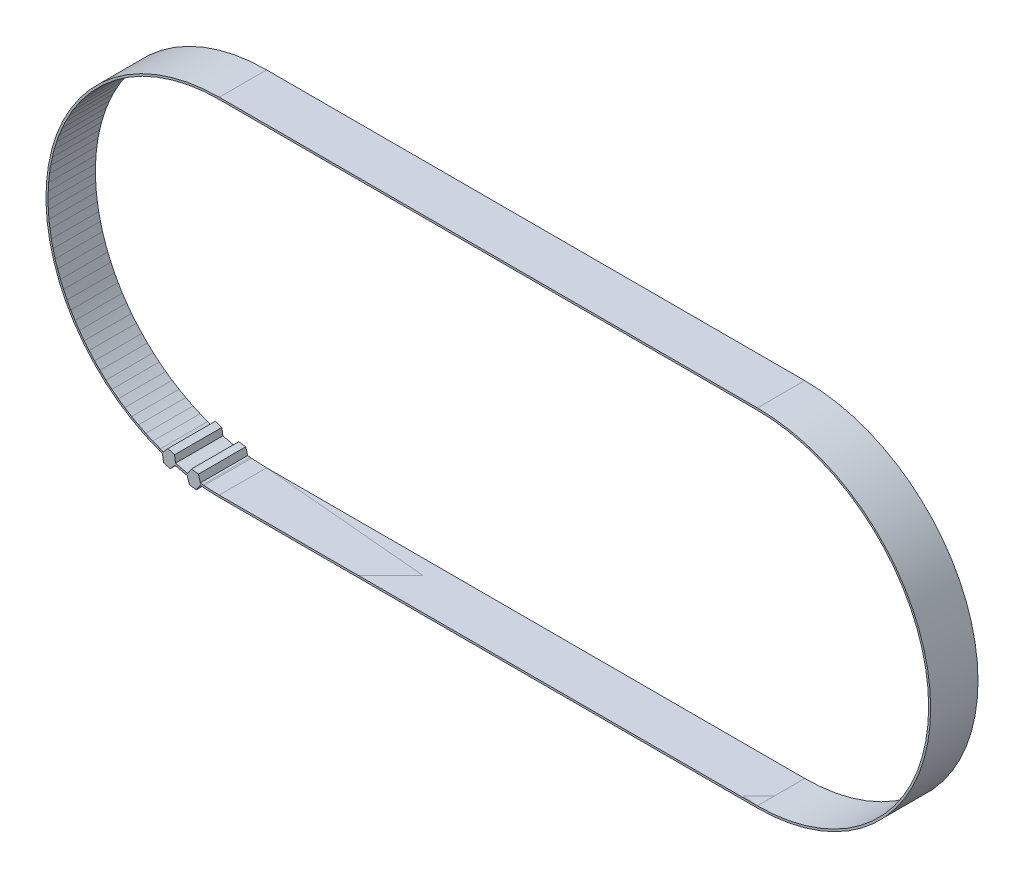
ISO-10303-21;
HEADER;
FILE_DESCRIPTION(('STEP AP214'),'2;1');
FILE_NAME('part.step','',(''),(''),'','','');
FILE_SCHEMA(('AUTOMOTIVE_DESIGN { 1 0 10303 214 1 1 1 1 }'));
ENDSEC;
DATA;
#1=APPLICATION_CONTEXT('core data for automotive mechanical design processes');
#2=APPLICATION_PROTOCOL_DEFINITION('international standard','automotive_design',2000,#1);
#3=PRODUCT_CONTEXT('',#1,'mechanical');
#4=PRODUCT('Part','Part','',(#3));
#5=PRODUCT_RELATED_PRODUCT_CATEGORY('part','',(#4));
#6=PRODUCT_DEFINITION_FORMATION('','',#4);
#7=PRODUCT_DEFINITION_CONTEXT('part definition',#1,'design');
#8=PRODUCT_DEFINITION('design','',#6,#7);
#9=PRODUCT_DEFINITION_SHAPE('','',#8);
#10=(LENGTH_UNIT() NAMED_UNIT(*) SI_UNIT(.MILLI.,.METRE.));
#11=(NAMED_UNIT(*) PLANE_ANGLE_UNIT() SI_UNIT($,.RADIAN.));
#12=(NAMED_UNIT(*) SI_UNIT($,.STERADIAN.) SOLID_ANGLE_UNIT());
#13=UNCERTAINTY_MEASURE_WITH_UNIT(LENGTH_MEASURE(1.E-05),#10,'distance_accuracy_value','');
#14=(GEOMETRIC_REPRESENTATION_CONTEXT(3) GLOBAL_UNCERTAINTY_ASSIGNED_CONTEXT((#13)) GLOBAL_UNIT_ASSIGNED_CONTEXT((#10,
#11,#12)) REPRESENTATION_CONTEXT('',''));
#15=CARTESIAN_POINT('',(0.,0.,0.));
#16=DIRECTION('',(0.,0.,1.));
#17=DIRECTION('',(1.,0.,0.));
#18=AXIS2_PLACEMENT_3D('',#15,#16,#17);
#19=CARTESIAN_POINT('',(-58.59456374968,-35.77128986789,4.75));
#20=DIRECTION('',(-0.147301698054607,-0.98909160837115,0.));
#21=DIRECTION('',(0.98909160837115,-0.147301698054607,0.));
#22=AXIS2_PLACEMENT_3D('',#19,#20,#21);
#23=PLANE('',#22);
#24=DIRECTION('',(0.,0.,1.));
#25=VECTOR('',#24,1.);
#26=CARTESIAN_POINT('',(-58.5945637496801,-35.77128986789,4.75));
#27=LINE('',#26,#25);
#28=CARTESIAN_POINT('',(-58.59456374968,-35.77128986789,4.75));
#29=VERTEX_POINT('',#28);
#30=CARTESIAN_POINT('',(-58.59456374968,-35.77128986789,-4.75));
#31=VERTEX_POINT('',#30);
#32=EDGE_CURVE('P0_E142',#29,#31,#27,.F.);
#33=ORIENTED_EDGE('',*,*,#32,.F.);
#34=DIRECTION('',(0.98909160837115,-0.147301698054607,0.));
#35=VECTOR('',#34,1.);
#36=CARTESIAN_POINT('',(-58.59456374968,-35.77128986789,4.75));
#37=LINE('',#36,#35);
#38=CARTESIAN_POINT('',(-59.9792920014002,-35.5650674906111,4.75));
#39=VERTEX_POINT('',#38);
#40=EDGE_CURVE('P0_E138',#29,#39,#37,.F.);
#41=ORIENTED_EDGE('',*,*,#40,.T.);
#42=DIRECTION('',(0.,0.,1.));
#43=VECTOR('',#42,1.);
#44=CARTESIAN_POINT('',(-59.9792920014,-35.56506749061,4.75));
#45=LINE('',#44,#43);
#46=CARTESIAN_POINT('',(-59.9792920014002,-35.5650674906111,-4.75));
#47=VERTEX_POINT('',#46);
#48=EDGE_CURVE('P0_E223',#47,#39,#45,.T.);
#49=ORIENTED_EDGE('',*,*,#48,.F.);
#50=DIRECTION('',(0.98909160837115,-0.147301698054607,0.));
#51=VECTOR('',#50,1.);
#52=CARTESIAN_POINT('',(-58.59456374968,-35.77128986789,-4.75));
#53=LINE('',#52,#51);
#54=EDGE_CURVE('P0_E258',#47,#31,#53,.T.);
#55=ORIENTED_EDGE('',*,*,#54,.T.);
#56=EDGE_LOOP('',(#33,#41,#49,#55));
#57=FACE_BOUND('',#56,.T.);
#58=ADVANCED_FACE('P0_F17',(#57),#23,.T.);
#59=CARTESIAN_POINT('',(-64.27842042492,-31.42285414019,4.75));
#60=DIRECTION('',(0.291389746889314,0.956604419500444,0.));
#61=DIRECTION('',(-0.956604419500444,0.291389746889314,0.));
#62=AXIS2_PLACEMENT_3D('',#59,#60,#61);
#63=PLANE('',#62);
#64=DIRECTION('',(0.,0.,1.));
#65=VECTOR('',#64,1.);
#66=CARTESIAN_POINT('',(-64.2784204249181,-31.4228541401918,4.75));
#67=LINE('',#66,#65);
#68=CARTESIAN_POINT('',(-64.2784204249187,-31.4228541401912,4.75));
#69=VERTEX_POINT('',#68);
#70=CARTESIAN_POINT('',(-64.2784204249187,-31.4228541401912,-4.75));
#71=VERTEX_POINT('',#70);
#72=EDGE_CURVE('P0_E203',#69,#71,#67,.F.);
#73=ORIENTED_EDGE('',*,*,#72,.F.);
#74=DIRECTION('',(-0.956604419500444,0.291389746889314,0.));
#75=VECTOR('',#74,1.);
#76=CARTESIAN_POINT('',(-64.27842042492,-31.42285414019,4.75));
#77=LINE('',#76,#75);
#78=CARTESIAN_POINT('',(-62.9391742376195,-31.8307997858384,4.75));
#79=VERTEX_POINT('',#78);
#80=EDGE_CURVE('P0_E239',#69,#79,#77,.F.);
#81=ORIENTED_EDGE('',*,*,#80,.T.);
#82=DIRECTION('',(0.,0.,1.));
#83=VECTOR('',#82,1.);
#84=CARTESIAN_POINT('',(-62.93917423762,-31.83079978584,4.75));
#85=LINE('',#84,#83);
#86=CARTESIAN_POINT('',(-62.9391742376195,-31.8307997858384,-4.75));
#87=VERTEX_POINT('',#86);
#88=EDGE_CURVE('P0_E197',#87,#79,#85,.T.);
#89=ORIENTED_EDGE('',*,*,#88,.F.);
#90=DIRECTION('',(-0.956604419500444,0.291389746889314,0.));
#91=VECTOR('',#90,1.);
#92=CARTESIAN_POINT('',(-64.27842042492,-31.42285414019,-4.75));
#93=LINE('',#92,#91);
#94=EDGE_CURVE('P0_E246',#87,#71,#93,.T.);
#95=ORIENTED_EDGE('',*,*,#94,.T.);
#96=EDGE_LOOP('',(#73,#81,#89,#95));
#97=FACE_BOUND('',#96,.T.);
#98=ADVANCED_FACE('P0_F438',(#97),#63,.T.);
#99=CARTESIAN_POINT('',(-59.53738690724,-32.5977926655,4.75));
#100=DIRECTION('',(0.147301698054607,0.98909160837115,0.));
#101=DIRECTION('',(-0.98909160837115,0.147301698054607,0.));
#102=AXIS2_PLACEMENT_3D('',#99,#100,#101);
#103=PLANE('',#102);
#104=DIRECTION('',(0.,0.,1.));
#105=VECTOR('',#104,1.);
#106=CARTESIAN_POINT('',(-59.5373869072399,-32.5977926655,4.75));
#107=LINE('',#106,#105);
#108=CARTESIAN_POINT('',(-59.5373869072399,-32.5977926655,4.75));
#109=VERTEX_POINT('',#108);
#110=CARTESIAN_POINT('',(-59.53738690724,-32.5977926655,-4.75));
#111=VERTEX_POINT('',#110);
#112=EDGE_CURVE('P0_E191',#109,#111,#107,.F.);
#113=ORIENTED_EDGE('',*,*,#112,.F.);
#114=DIRECTION('',(-0.98909160837115,0.147301698054607,0.));
#115=VECTOR('',#114,1.);
#116=CARTESIAN_POINT('',(-59.53738690724,-32.5977926655,4.75));
#117=LINE('',#116,#115);
#118=CARTESIAN_POINT('',(-58.1526586555198,-32.8040150427789,4.75));
#119=VERTEX_POINT('',#118);
#120=EDGE_CURVE('P0_E233',#109,#119,#117,.F.);
#121=ORIENTED_EDGE('',*,*,#120,.T.);
#122=DIRECTION('',(0.,0.,1.));
#123=VECTOR('',#122,1.);
#124=CARTESIAN_POINT('',(-58.15265865552,-32.80401504278,4.75));
#125=LINE('',#124,#123);
#126=CARTESIAN_POINT('',(-58.1526586555198,-32.8040150427789,-4.75));
#127=VERTEX_POINT('',#126);
#128=EDGE_CURVE('P0_E209',#127,#119,#125,.T.);
#129=ORIENTED_EDGE('',*,*,#128,.F.);
#130=DIRECTION('',(-0.98909160837115,0.147301698054607,0.));
#131=VECTOR('',#130,1.);
#132=CARTESIAN_POINT('',(-59.53738690724,-32.5977926655,-4.75));
#133=LINE('',#132,#131);
#134=EDGE_CURVE('P0_E236',#127,#111,#133,.T.);
#135=ORIENTED_EDGE('',*,*,#134,.T.);
#136=EDGE_LOOP('',(#113,#121,#129,#135));
#137=FACE_BOUND('',#136,.T.);
#138=ADVANCED_FACE('P0_F353',(#137),#103,.T.);
#139=CARTESIAN_POINT('',(-63.81334347829,-34.70061304434,4.75));
#140=DIRECTION('',(-0.291389746889314,-0.956604419500444,0.));
#141=DIRECTION('',(0.956604419500444,-0.291389746889314,0.));
#142=AXIS2_PLACEMENT_3D('',#139,#140,#141);
#143=PLANE('',#142);
#144=DIRECTION('',(0.,0.,1.));
#145=VECTOR('',#144,1.);
#146=CARTESIAN_POINT('',(-63.813343478292,-34.7006130443382,4.75));
#147=LINE('',#146,#145);
#148=CARTESIAN_POINT('',(-63.8133434782913,-34.7006130443388,4.75));
#149=VERTEX_POINT('',#148);
#150=CARTESIAN_POINT('',(-63.8133434782913,-34.7006130443388,-4.75));
#151=VERTEX_POINT('',#150);
#152=EDGE_CURVE('P0_E217',#149,#151,#147,.F.);
#153=ORIENTED_EDGE('',*,*,#152,.F.);
#154=DIRECTION('',(0.956604419500444,-0.291389746889314,0.));
#155=VECTOR('',#154,1.);
#156=CARTESIAN_POINT('',(-63.81334347829,-34.70061304434,4.75));
#157=LINE('',#156,#155);
#158=CARTESIAN_POINT('',(-65.1525896655895,-34.2926673986985,4.75));
#159=VERTEX_POINT('',#158);
#160=EDGE_CURVE('P0_E143',#149,#159,#157,.F.);
#161=ORIENTED_EDGE('',*,*,#160,.T.);
#162=DIRECTION('',(0.,0.,1.));
#163=VECTOR('',#162,1.);
#164=CARTESIAN_POINT('',(-65.15258966559,-34.2926673987,4.75));
#165=LINE('',#164,#163);
#166=CARTESIAN_POINT('',(-65.1525896655895,-34.2926673986985,-4.75));
#167=VERTEX_POINT('',#166);
#168=EDGE_CURVE('P0_E187',#167,#159,#165,.T.);
#169=ORIENTED_EDGE('',*,*,#168,.F.);
#170=DIRECTION('',(0.956604419500444,-0.291389746889314,0.));
#171=VECTOR('',#170,1.);
#172=CARTESIAN_POINT('',(-63.81334347829,-34.70061304434,-4.75));
#173=LINE('',#172,#171);
#174=EDGE_CURVE('P0_E230',#167,#151,#173,.T.);
#175=ORIENTED_EDGE('',*,*,#174,.T.);
#176=EDGE_LOOP('',(#153,#161,#169,#175));
#177=FACE_BOUND('',#176,.T.);
#178=ADVANCED_FACE('P0_F396',(#177),#143,.T.);
#179=CARTESIAN_POINT('',(-57.6817797152,-34.39068432013,4.75));
#180=DIRECTION('',(0.834169039176063,-0.551508852222776,0.));
#181=DIRECTION('',(0.551508852222776,0.834169039176063,0.));
#182=AXIS2_PLACEMENT_3D('',#179,#180,#181);
#183=PLANE('',#182);
#184=DIRECTION('',(0.551508852222776,0.834169039176063,0.));
#185=VECTOR('',#184,1.);
#186=CARTESIAN_POINT('',(-57.6817797152,-34.39068432013,-4.75));
#187=LINE('',#186,#185);
#188=CARTESIAN_POINT('',(-57.7882770687173,-34.5517645033052,-4.75));
#189=VERTEX_POINT('',#188);
#190=EDGE_CURVE('P0_E149',#31,#189,#187,.T.);
#191=ORIENTED_EDGE('',*,*,#190,.T.);
#192=DIRECTION('',(0.,0.,-1.));
#193=VECTOR('',#192,1.);
#194=CARTESIAN_POINT('',(-57.7882766755705,-34.5517645466945,1.));
#195=LINE('',#194,#193);
#196=CARTESIAN_POINT('',(-57.7882770687173,-34.5517645033052,4.75));
#197=VERTEX_POINT('',#196);
#198=EDGE_CURVE('P0_E146',#197,#189,#195,.T.);
#199=ORIENTED_EDGE('',*,*,#198,.F.);
#200=DIRECTION('',(0.551508852222776,0.834169039176063,0.));
#201=VECTOR('',#200,1.);
#202=CARTESIAN_POINT('',(-57.6817797152,-34.39068432013,4.75));
#203=LINE('',#202,#201);
#204=EDGE_CURVE('P0_E130',#197,#29,#203,.F.);
#205=ORIENTED_EDGE('',*,*,#204,.T.);
#206=ORIENTED_EDGE('',*,*,#32,.T.);
#207=EDGE_LOOP('',(#191,#199,#205,#206));
#208=FACE_BOUND('',#207,.T.);
#209=ADVANCED_FACE('P0_F147',(#208),#183,.T.);
#210=CARTESIAN_POINT('',(-59.9792920014,-35.56506749061,4.75));
#211=DIRECTION('',(-0.958673814342677,-0.284507500241493,0.));
#212=DIRECTION('',(0.284507500241493,-0.958673814342677,0.));
#213=AXIS2_PLACEMENT_3D('',#210,#211,#212);
#214=PLANE('',#213);
#215=DIRECTION('',(0.284507500241493,-0.958673814342677,0.));
#216=VECTOR('',#215,1.);
#217=CARTESIAN_POINT('',(-59.9792920014,-35.56506749061,4.75));
#218=LINE('',#217,#216);
#219=CARTESIAN_POINT('',(-60.3952318718346,-34.1635205300412,4.75));
#220=VERTEX_POINT('',#219);
#221=EDGE_CURVE('P0_E218',#39,#220,#218,.F.);
#222=ORIENTED_EDGE('',*,*,#221,.T.);
#223=DIRECTION('',(0.,0.,-1.));
#224=VECTOR('',#223,1.);
#225=CARTESIAN_POINT('',(-60.3952319159177,-34.1635205217568,1.));
#226=LINE('',#225,#224);
#227=CARTESIAN_POINT('',(-60.3952318718346,-34.1635205300412,-4.75));
#228=VERTEX_POINT('',#227);
#229=EDGE_CURVE('P0_E153',#228,#220,#226,.F.);
#230=ORIENTED_EDGE('',*,*,#229,.F.);
#231=DIRECTION('',(0.284507500241493,-0.958673814342677,0.));
#232=VECTOR('',#231,1.);
#233=CARTESIAN_POINT('',(-59.9792920014,-35.56506749061,-4.75));
#234=LINE('',#233,#232);
#235=EDGE_CURVE('P0_E220',#228,#47,#234,.T.);
#236=ORIENTED_EDGE('',*,*,#235,.T.);
#237=ORIENTED_EDGE('',*,*,#48,.T.);
#238=EDGE_LOOP('',(#222,#230,#236,#237));
#239=FACE_BOUND('',#238,.T.);
#240=ADVANCED_FACE('P0_F384',(#239),#214,.T.);
#241=CARTESIAN_POINT('',(-62.707150908,-33.46952232081,4.75));
#242=DIRECTION('',(0.743831406187488,-0.668367293611189,0.));
#243=DIRECTION('',(0.668367293611189,0.743831406187488,0.));
#244=AXIS2_PLACEMENT_3D('',#241,#242,#243);
#245=PLANE('',#244);
#246=DIRECTION('',(0.668367293611189,0.743831406187488,0.));
#247=VECTOR('',#246,1.);
#248=CARTESIAN_POINT('',(-62.707150908,-33.46952232081,-4.75));
#249=LINE('',#248,#247);
#250=CARTESIAN_POINT('',(-62.8362141510328,-33.6131580793029,-4.75));
#251=VERTEX_POINT('',#250);
#252=EDGE_CURVE('P0_E213',#151,#251,#249,.T.);
#253=ORIENTED_EDGE('',*,*,#252,.T.);
#254=DIRECTION('',(0.,0.,-1.));
#255=VECTOR('',#254,1.);
#256=CARTESIAN_POINT('',(-62.8362139884102,-33.613158122174,1.));
#257=LINE('',#256,#255);
#258=CARTESIAN_POINT('',(-62.8362141510328,-33.6131580793029,4.75));
#259=VERTEX_POINT('',#258);
#260=EDGE_CURVE('P0_E176',#259,#251,#257,.T.);
#261=ORIENTED_EDGE('',*,*,#260,.F.);
#262=DIRECTION('',(0.668367293611189,0.743831406187488,0.));
#263=VECTOR('',#262,1.);
#264=CARTESIAN_POINT('',(-62.707150908,-33.46952232081,4.75));
#265=LINE('',#264,#263);
#266=EDGE_CURVE('P0_E214',#259,#149,#265,.F.);
#267=ORIENTED_EDGE('',*,*,#266,.T.);
#268=ORIENTED_EDGE('',*,*,#152,.T.);
#269=EDGE_LOOP('',(#253,#261,#267,#268));
#270=FACE_BOUND('',#269,.T.);
#271=ADVANCED_FACE('P0_F394',(#270),#245,.T.);
#272=CARTESIAN_POINT('',(-58.15265865552,-32.80401504278,4.75));
#273=DIRECTION('',(0.958673814342677,0.284507500241493,0.));
#274=DIRECTION('',(-0.284507500241493,0.958673814342677,0.));
#275=AXIS2_PLACEMENT_3D('',#272,#273,#274);
#276=PLANE('',#275);
#277=DIRECTION('',(-0.284507500241493,0.958673814342677,0.));
#278=VECTOR('',#277,1.);
#279=CARTESIAN_POINT('',(-58.15265865552,-32.80401504278,4.75));
#280=LINE('',#279,#278);
#281=CARTESIAN_POINT('',(-57.7522247293261,-34.1533138050761,4.75));
#282=VERTEX_POINT('',#281);
#283=EDGE_CURVE('P0_E207',#119,#282,#280,.F.);
#284=ORIENTED_EDGE('',*,*,#283,.T.);
#285=DIRECTION('',(0.,0.,-1.));
#286=VECTOR('',#285,1.);
#287=CARTESIAN_POINT('',(-57.752224835584,-34.1533137933244,1.));
#288=LINE('',#287,#286);
#289=CARTESIAN_POINT('',(-57.7522247293261,-34.1533138050761,-4.75));
#290=VERTEX_POINT('',#289);
#291=EDGE_CURVE('P0_E174',#282,#290,#288,.T.);
#292=ORIENTED_EDGE('',*,*,#291,.T.);
#293=DIRECTION('',(-0.284507500241493,0.958673814342677,0.));
#294=VECTOR('',#293,1.);
#295=CARTESIAN_POINT('',(-58.15265865552,-32.80401504278,-4.75));
#296=LINE('',#295,#294);
#297=EDGE_CURVE('P0_E210',#290,#127,#296,.T.);
#298=ORIENTED_EDGE('',*,*,#297,.T.);
#299=ORIENTED_EDGE('',*,*,#128,.T.);
#300=EDGE_LOOP('',(#284,#292,#298,#299));
#301=FACE_BOUND('',#300,.T.);
#302=ADVANCED_FACE('P0_F336',(#301),#276,.T.);
#303=CARTESIAN_POINT('',(-65.38461299521,-32.65394486372,4.75));
#304=DIRECTION('',(-0.743831406187488,0.668367293611189,0.));
#305=DIRECTION('',(-0.668367293611189,-0.743831406187488,0.));
#306=AXIS2_PLACEMENT_3D('',#303,#304,#305);
#307=PLANE('',#306);
#308=DIRECTION('',(-0.668367293611189,-0.743831406187488,0.));
#309=VECTOR('',#308,1.);
#310=CARTESIAN_POINT('',(-65.38461299521,-32.65394486372,-4.75));
#311=LINE('',#310,#309);
#312=CARTESIAN_POINT('',(-65.2191231874016,-32.4697700064287,-4.75));
#313=VERTEX_POINT('',#312);
#314=EDGE_CURVE('P0_E201',#71,#313,#311,.T.);
#315=ORIENTED_EDGE('',*,*,#314,.T.);
#316=DIRECTION('',(0.,0.,-1.));
#317=VECTOR('',#316,1.);
#318=CARTESIAN_POINT('',(-65.219123120208,-32.4697700296975,1.));
#319=LINE('',#318,#317);
#320=CARTESIAN_POINT('',(-65.2191231874016,-32.4697700064287,4.75));
#321=VERTEX_POINT('',#320);
#322=EDGE_CURVE('P0_E321',#313,#321,#319,.F.);
#323=ORIENTED_EDGE('',*,*,#322,.T.);
#324=DIRECTION('',(-0.668367293611189,-0.743831406187488,0.));
#325=VECTOR('',#324,1.);
#326=CARTESIAN_POINT('',(-65.38461299521,-32.65394486372,4.75));
#327=LINE('',#326,#325);
#328=EDGE_CURVE('P0_E204',#321,#69,#327,.F.);
#329=ORIENTED_EDGE('',*,*,#328,.T.);
#330=ORIENTED_EDGE('',*,*,#72,.T.);
#331=EDGE_LOOP('',(#315,#323,#329,#330));
#332=FACE_BOUND('',#331,.T.);
#333=ADVANCED_FACE('P0_F434',(#332),#307,.T.);
#334=CARTESIAN_POINT('',(-62.93917423762,-31.83079978584,4.75));
#335=DIRECTION('',(0.990124662826355,0.140189700274294,0.));
#336=DIRECTION('',(-0.140189700274294,0.990124662826355,0.));
#337=AXIS2_PLACEMENT_3D('',#334,#335,#336);
#338=PLANE('',#337);
#339=DIRECTION('',(-0.140189700274294,0.990124662826355,0.));
#340=VECTOR('',#339,1.);
#341=CARTESIAN_POINT('',(-62.93917423762,-31.83079978584,4.75));
#342=LINE('',#341,#340);
#343=CARTESIAN_POINT('',(-62.7418624258908,-33.2243644593744,4.75));
#344=VERTEX_POINT('',#343);
#345=EDGE_CURVE('P0_E195',#79,#344,#342,.F.);
#346=ORIENTED_EDGE('',*,*,#345,.T.);
#347=DIRECTION('',(0.,0.,-1.));
#348=VECTOR('',#347,1.);
#349=CARTESIAN_POINT('',(-62.7418625547665,-33.2243644253682,1.));
#350=LINE('',#349,#348);
#351=CARTESIAN_POINT('',(-62.7418624258908,-33.2243644593744,-4.75));
#352=VERTEX_POINT('',#351);
#353=EDGE_CURVE('P0_E170',#344,#352,#350,.T.);
#354=ORIENTED_EDGE('',*,*,#353,.T.);
#355=DIRECTION('',(-0.140189700274294,0.990124662826355,0.));
#356=VECTOR('',#355,1.);
#357=CARTESIAN_POINT('',(-62.93917423762,-31.83079978584,-4.75));
#358=LINE('',#357,#356);
#359=EDGE_CURVE('P0_E198',#352,#87,#358,.T.);
#360=ORIENTED_EDGE('',*,*,#359,.T.);
#361=ORIENTED_EDGE('',*,*,#88,.T.);
#362=EDGE_LOOP('',(#346,#354,#360,#361));
#363=FACE_BOUND('',#362,.T.);
#364=ADVANCED_FACE('P0_F441',(#363),#338,.T.);
#365=CARTESIAN_POINT('',(-60.45017094172,-33.97839821326,4.75));
#366=DIRECTION('',(-0.834169039176063,0.551508852222776,0.));
#367=DIRECTION('',(-0.551508852222776,-0.834169039176063,0.));
#368=AXIS2_PLACEMENT_3D('',#365,#366,#367);
#369=PLANE('',#368);
#370=DIRECTION('',(-0.551508852222776,-0.834169039176063,0.));
#371=VECTOR('',#370,1.);
#372=CARTESIAN_POINT('',(-60.45017094172,-33.97839821326,-4.75));
#373=LINE('',#372,#371);
#374=CARTESIAN_POINT('',(-60.3136156625387,-33.7718554717749,-4.75));
#375=VERTEX_POINT('',#374);
#376=EDGE_CURVE('P0_E188',#111,#375,#373,.T.);
#377=ORIENTED_EDGE('',*,*,#376,.T.);
#378=DIRECTION('',(0.,0.,-1.));
#379=VECTOR('',#378,1.);
#380=CARTESIAN_POINT('',(-60.3136156244258,-33.7718554789283,1.));
#381=LINE('',#380,#379);
#382=CARTESIAN_POINT('',(-60.3136156625387,-33.7718554717749,4.75));
#383=VERTEX_POINT('',#382);
#384=EDGE_CURVE('P0_E164',#375,#383,#381,.F.);
#385=ORIENTED_EDGE('',*,*,#384,.T.);
#386=DIRECTION('',(-0.551508852222776,-0.834169039176063,0.));
#387=VECTOR('',#386,1.);
#388=CARTESIAN_POINT('',(-60.45017094172,-33.97839821326,4.75));
#389=LINE('',#388,#387);
#390=EDGE_CURVE('P0_E192',#383,#109,#389,.F.);
#391=ORIENTED_EDGE('',*,*,#390,.T.);
#392=ORIENTED_EDGE('',*,*,#112,.T.);
#393=EDGE_LOOP('',(#377,#385,#391,#392));
#394=FACE_BOUND('',#393,.T.);
#395=ADVANCED_FACE('P0_F449',(#394),#369,.T.);
#396=CARTESIAN_POINT('',(-65.15258966559,-34.2926673987,4.75));
#397=DIRECTION('',(-0.990124662826355,-0.140189700274294,0.));
#398=DIRECTION('',(0.140189700274294,-0.990124662826355,0.));
#399=AXIS2_PLACEMENT_3D('',#396,#397,#398);
#400=PLANE('',#399);
#401=DIRECTION('',(0.140189700274294,-0.990124662826355,0.));
#402=VECTOR('',#401,1.);
#403=CARTESIAN_POINT('',(-65.15258966559,-34.2926673987,4.75));
#404=LINE('',#403,#402);
#405=CARTESIAN_POINT('',(-65.3575420963142,-32.8451403973298,4.75));
#406=VERTEX_POINT('',#405);
#407=EDGE_CURVE('P0_E154',#159,#406,#404,.F.);
#408=ORIENTED_EDGE('',*,*,#407,.T.);
#409=DIRECTION('',(0.,0.,-1.));
#410=VECTOR('',#409,1.);
#411=CARTESIAN_POINT('',(-65.3575421811805,-32.8451403679192,1.));
#412=LINE('',#411,#410);
#413=CARTESIAN_POINT('',(-65.3575420963142,-32.8451403973298,-4.75));
#414=VERTEX_POINT('',#413);
#415=EDGE_CURVE('P0_E160',#414,#406,#412,.F.);
#416=ORIENTED_EDGE('',*,*,#415,.F.);
#417=DIRECTION('',(0.140189700274294,-0.990124662826355,0.));
#418=VECTOR('',#417,1.);
#419=CARTESIAN_POINT('',(-65.15258966559,-34.2926673987,-4.75));
#420=LINE('',#419,#418);
#421=EDGE_CURVE('P0_E184',#414,#167,#420,.T.);
#422=ORIENTED_EDGE('',*,*,#421,.T.);
#423=ORIENTED_EDGE('',*,*,#168,.T.);
#424=EDGE_LOOP('',(#408,#416,#422,#423));
#425=FACE_BOUND('',#424,.T.);
#426=ADVANCED_FACE('P0_F403',(#425),#400,.T.);
#427=CARTESIAN_POINT('',(-53.975,0.,1.));
#428=DIRECTION('',(0.,0.,-1.));
#429=DIRECTION('',(-1.,0.,0.));
#430=AXIS2_PLACEMENT_3D('',#427,#428,#429);
#431=CYLINDRICAL_SURFACE('',#430,34.76155221354);
#432=ORIENTED_EDGE('',*,*,#198,.T.);
#433=CARTESIAN_POINT('',(-53.975,0.,-4.75));
#434=DIRECTION('',(0.,0.,-1.));
#435=DIRECTION('',(-1.,0.,0.));
#436=AXIS2_PLACEMENT_3D('',#433,#434,#435);
#437=CIRCLE('',#436,34.76155221354);
#438=CARTESIAN_POINT('',(-53.975,-34.76155221354,-4.75));
#439=VERTEX_POINT('',#438);
#440=EDGE_CURVE('P0_E289',#439,#189,#437,.T.);
#441=ORIENTED_EDGE('',*,*,#440,.F.);
#442=DIRECTION('',(0.,0.,-1.));
#443=VECTOR('',#442,1.);
#444=CARTESIAN_POINT('',(-53.975,-34.76155221354,-4.75));
#445=LINE('',#444,#443);
#446=CARTESIAN_POINT('',(-53.975,-34.76155221354,4.75));
#447=VERTEX_POINT('',#446);
#448=EDGE_CURVE('P0_E157',#447,#439,#445,.T.);
#449=ORIENTED_EDGE('',*,*,#448,.F.);
#450=CARTESIAN_POINT('',(-53.975,0.,4.75));
#451=DIRECTION('',(0.,0.,-1.));
#452=DIRECTION('',(-1.,0.,0.));
#453=AXIS2_PLACEMENT_3D('',#450,#451,#452);
#454=CIRCLE('',#453,34.76155221354);
#455=EDGE_CURVE('P0_E20',#197,#447,#454,.F.);
#456=ORIENTED_EDGE('',*,*,#455,.F.);
#457=EDGE_LOOP('',(#432,#441,#449,#456));
#458=FACE_BOUND('',#457,.T.);
#459=ADVANCED_FACE('P0_F156',(#458),#431,.T.);
#460=CARTESIAN_POINT('',(-53.975,0.,1.));
#461=DIRECTION('',(0.,0.,-1.));
#462=DIRECTION('',(-1.,0.,0.));
#463=AXIS2_PLACEMENT_3D('',#460,#461,#462);
#464=CYLINDRICAL_SURFACE('',#463,34.76155221354);
#465=CARTESIAN_POINT('',(-53.975,0.,4.75));
#466=DIRECTION('',(0.,0.,-1.));
#467=DIRECTION('',(-1.,0.,0.));
#468=AXIS2_PLACEMENT_3D('',#465,#466,#467);
#469=CIRCLE('',#468,34.76155221354);
#470=EDGE_CURVE('P0_E162',#259,#220,#469,.F.);
#471=ORIENTED_EDGE('',*,*,#470,.F.);
#472=ORIENTED_EDGE('',*,*,#260,.T.);
#473=CARTESIAN_POINT('',(-53.975,0.,-4.75));
#474=DIRECTION('',(0.,0.,-1.));
#475=DIRECTION('',(-1.,0.,0.));
#476=AXIS2_PLACEMENT_3D('',#473,#474,#475);
#477=CIRCLE('',#476,34.76155221354);
#478=EDGE_CURVE('P0_E286',#228,#251,#477,.T.);
#479=ORIENTED_EDGE('',*,*,#478,.F.);
#480=ORIENTED_EDGE('',*,*,#229,.T.);
#481=EDGE_LOOP('',(#471,#472,#479,#480));
#482=FACE_BOUND('',#481,.T.);
#483=ADVANCED_FACE('P0_F387',(#482),#464,.T.);
#484=CARTESIAN_POINT('',(-53.975,0.,1.));
#485=DIRECTION('',(0.,0.,-1.));
#486=DIRECTION('',(-1.,0.,0.));
#487=AXIS2_PLACEMENT_3D('',#484,#485,#486);
#488=CYLINDRICAL_SURFACE('',#487,34.36155221354);
#489=DIRECTION('',(0.,0.,1.));
#490=VECTOR('',#489,1.);
#491=CARTESIAN_POINT('',(-53.975,-34.36155221354,4.75));
#492=LINE('',#491,#490);
#493=CARTESIAN_POINT('',(-53.975,-34.36155221354,-4.75));
#494=VERTEX_POINT('',#493);
#495=CARTESIAN_POINT('',(-53.975,-34.36155221354,4.75));
#496=VERTEX_POINT('',#495);
#497=EDGE_CURVE('P0_E327',#494,#496,#492,.T.);
#498=ORIENTED_EDGE('',*,*,#497,.F.);
#499=CARTESIAN_POINT('',(-53.975,0.,-4.75));
#500=DIRECTION('',(0.,0.,-1.));
#501=DIRECTION('',(-1.,0.,0.));
#502=AXIS2_PLACEMENT_3D('',#499,#500,#501);
#503=CIRCLE('',#502,34.36155221354);
#504=EDGE_CURVE('P0_E281',#290,#494,#503,.F.);
#505=ORIENTED_EDGE('',*,*,#504,.F.);
#506=ORIENTED_EDGE('',*,*,#291,.F.);
#507=CARTESIAN_POINT('',(-53.975,0.,4.75));
#508=DIRECTION('',(0.,0.,-1.));
#509=DIRECTION('',(-1.,0.,0.));
#510=AXIS2_PLACEMENT_3D('',#507,#508,#509);
#511=CIRCLE('',#510,34.36155221354);
#512=EDGE_CURVE('P0_E297',#496,#282,#511,.T.);
#513=ORIENTED_EDGE('',*,*,#512,.F.);
#514=EDGE_LOOP('',(#498,#505,#506,#513));
#515=FACE_BOUND('',#514,.T.);
#516=ADVANCED_FACE('P0_F340',(#515),#488,.F.);
#517=CARTESIAN_POINT('',(53.975,-34.36155221354,4.75));
#518=DIRECTION('',(0.,1.,0.));
#519=DIRECTION('',(0.,0.,1.));
#520=AXIS2_PLACEMENT_3D('',#517,#518,#519);
#521=PLANE('',#520);
#522=DIRECTION('',(1.,0.,0.));
#523=VECTOR('',#522,1.);
#524=CARTESIAN_POINT('',(-53.975,-34.36155221354,4.75));
#525=LINE('',#524,#523);
#526=CARTESIAN_POINT('',(53.975,-34.36155221354,4.75));
#527=VERTEX_POINT('',#526);
#528=EDGE_CURVE('P0_E300',#527,#496,#525,.F.);
#529=ORIENTED_EDGE('',*,*,#528,.F.);
#530=DIRECTION('',(0.,0.,-1.));
#531=VECTOR('',#530,1.);
#532=CARTESIAN_POINT('',(53.975,-34.36155221354,1.));
#533=LINE('',#532,#531);
#534=CARTESIAN_POINT('',(53.975,-34.36155221354,-4.75));
#535=VERTEX_POINT('',#534);
#536=EDGE_CURVE('P0_E326',#527,#535,#533,.T.);
#537=ORIENTED_EDGE('',*,*,#536,.T.);
#538=DIRECTION('',(-1.,0.,0.));
#539=VECTOR('',#538,1.);
#540=CARTESIAN_POINT('',(-53.975,-34.36155221354,-4.75));
#541=LINE('',#540,#539);
#542=EDGE_CURVE('P0_E280',#494,#535,#541,.F.);
#543=ORIENTED_EDGE('',*,*,#542,.F.);
#544=ORIENTED_EDGE('',*,*,#497,.T.);
#545=EDGE_LOOP('',(#529,#537,#543,#544));
#546=FACE_BOUND('',#545,.T.);
#547=ADVANCED_FACE('P0_F451',(#546),#521,.T.);
#548=CARTESIAN_POINT('',(53.975,0.,1.));
#549=DIRECTION('',(0.,0.,-1.));
#550=DIRECTION('',(-1.,0.,0.));
#551=AXIS2_PLACEMENT_3D('',#548,#549,#550);
#552=CYLINDRICAL_SURFACE('',#551,34.36155221354);
#553=ORIENTED_EDGE('',*,*,#536,.F.);
#554=CARTESIAN_POINT('',(53.975,0.,4.75));
#555=DIRECTION('',(0.,0.,-1.));
#556=DIRECTION('',(-1.,0.,0.));
#557=AXIS2_PLACEMENT_3D('',#554,#555,#556);
#558=CIRCLE('',#557,34.36155221354);
#559=CARTESIAN_POINT('',(53.975,34.36155221354,4.75));
#560=VERTEX_POINT('',#559);
#561=EDGE_CURVE('P0_E301',#560,#527,#558,.T.);
#562=ORIENTED_EDGE('',*,*,#561,.F.);
#563=DIRECTION('',(0.,0.,-1.));
#564=VECTOR('',#563,1.);
#565=CARTESIAN_POINT('',(53.975,34.36155221354,4.75));
#566=LINE('',#565,#564);
#567=CARTESIAN_POINT('',(53.975,34.36155221354,-4.75));
#568=VERTEX_POINT('',#567);
#569=EDGE_CURVE('P0_E324',#568,#560,#566,.F.);
#570=ORIENTED_EDGE('',*,*,#569,.F.);
#571=CARTESIAN_POINT('',(53.975,0.,-4.75));
#572=DIRECTION('',(0.,0.,-1.));
#573=DIRECTION('',(-1.,0.,0.));
#574=AXIS2_PLACEMENT_3D('',#571,#572,#573);
#575=CIRCLE('',#574,34.36155221354);
#576=EDGE_CURVE('P0_E277',#535,#568,#575,.F.);
#577=ORIENTED_EDGE('',*,*,#576,.F.);
#578=EDGE_LOOP('',(#553,#562,#570,#577));
#579=FACE_BOUND('',#578,.T.);
#580=ADVANCED_FACE('P0_F453',(#579),#552,.F.);
#581=CARTESIAN_POINT('',(-53.975,34.36155221354,4.75));
#582=DIRECTION('',(0.,-1.,0.));
#583=DIRECTION('',(0.,0.,-1.));
#584=AXIS2_PLACEMENT_3D('',#581,#582,#583);
#585=PLANE('',#584);
#586=DIRECTION('',(1.,0.,0.));
#587=VECTOR('',#586,1.);
#588=CARTESIAN_POINT('',(-53.975,34.36155221354,4.75));
#589=LINE('',#588,#587);
#590=CARTESIAN_POINT('',(-53.975,34.36155221354,4.75));
#591=VERTEX_POINT('',#590);
#592=EDGE_CURVE('P0_E304',#591,#560,#589,.T.);
#593=ORIENTED_EDGE('',*,*,#592,.F.);
#594=DIRECTION('',(0.,0.,-1.));
#595=VECTOR('',#594,1.);
#596=CARTESIAN_POINT('',(-53.975,34.36155221354,1.));
#597=LINE('',#596,#595);
#598=CARTESIAN_POINT('',(-53.975,34.36155221354,-4.75));
#599=VERTEX_POINT('',#598);
#600=EDGE_CURVE('P0_E318',#591,#599,#597,.T.);
#601=ORIENTED_EDGE('',*,*,#600,.T.);
#602=DIRECTION('',(-1.,0.,0.));
#603=VECTOR('',#602,1.);
#604=CARTESIAN_POINT('',(-53.975,34.36155221354,-4.75));
#605=LINE('',#604,#603);
#606=EDGE_CURVE('P0_E276',#568,#599,#605,.T.);
#607=ORIENTED_EDGE('',*,*,#606,.F.);
#608=ORIENTED_EDGE('',*,*,#569,.T.);
#609=EDGE_LOOP('',(#593,#601,#607,#608));
#610=FACE_BOUND('',#609,.T.);
#611=ADVANCED_FACE('P0_F426',(#610),#585,.T.);
#612=CARTESIAN_POINT('',(-53.975,0.,1.));
#613=DIRECTION('',(0.,0.,-1.));
#614=DIRECTION('',(-1.,0.,0.));
#615=AXIS2_PLACEMENT_3D('',#612,#613,#614);
#616=CYLINDRICAL_SURFACE('',#615,34.36155221354);
#617=ORIENTED_EDGE('',*,*,#600,.F.);
#618=CARTESIAN_POINT('',(-53.975,0.,4.75));
#619=DIRECTION('',(0.,0.,-1.));
#620=DIRECTION('',(-1.,0.,0.));
#621=AXIS2_PLACEMENT_3D('',#618,#619,#620);
#622=CIRCLE('',#621,34.36155221354);
#623=EDGE_CURVE('P0_E291',#321,#591,#622,.T.);
#624=ORIENTED_EDGE('',*,*,#623,.F.);
#625=ORIENTED_EDGE('',*,*,#322,.F.);
#626=CARTESIAN_POINT('',(-53.975,0.,-4.75));
#627=DIRECTION('',(0.,0.,-1.));
#628=DIRECTION('',(-1.,0.,0.));
#629=AXIS2_PLACEMENT_3D('',#626,#627,#628);
#630=CIRCLE('',#629,34.36155221354);
#631=EDGE_CURVE('P0_E273',#599,#313,#630,.F.);
#632=ORIENTED_EDGE('',*,*,#631,.F.);
#633=EDGE_LOOP('',(#617,#624,#625,#632));
#634=FACE_BOUND('',#633,.T.);
#635=ADVANCED_FACE('P0_F432',(#634),#616,.F.);
#636=CARTESIAN_POINT('',(-53.975,0.,1.));
#637=DIRECTION('',(0.,0.,-1.));
#638=DIRECTION('',(-1.,0.,0.));
#639=AXIS2_PLACEMENT_3D('',#636,#637,#638);
#640=CYLINDRICAL_SURFACE('',#639,34.36155221354);
#641=ORIENTED_EDGE('',*,*,#384,.F.);
#642=CARTESIAN_POINT('',(-53.975,0.,-4.75));
#643=DIRECTION('',(0.,0.,-1.));
#644=DIRECTION('',(-1.,0.,0.));
#645=AXIS2_PLACEMENT_3D('',#642,#643,#644);
#646=CIRCLE('',#645,34.36155221354);
#647=EDGE_CURVE('P0_E269',#352,#375,#646,.F.);
#648=ORIENTED_EDGE('',*,*,#647,.F.);
#649=ORIENTED_EDGE('',*,*,#353,.F.);
#650=CARTESIAN_POINT('',(-53.975,0.,4.75));
#651=DIRECTION('',(0.,0.,-1.));
#652=DIRECTION('',(-1.,0.,0.));
#653=AXIS2_PLACEMENT_3D('',#650,#651,#652);
#654=CIRCLE('',#653,34.36155221354);
#655=EDGE_CURVE('P0_E294',#383,#344,#654,.T.);
#656=ORIENTED_EDGE('',*,*,#655,.F.);
#657=EDGE_LOOP('',(#641,#648,#649,#656));
#658=FACE_BOUND('',#657,.T.);
#659=ADVANCED_FACE('P0_F447',(#658),#640,.F.);
#660=CARTESIAN_POINT('',(-53.975,0.,1.));
#661=DIRECTION('',(0.,0.,-1.));
#662=DIRECTION('',(-1.,0.,0.));
#663=AXIS2_PLACEMENT_3D('',#660,#661,#662);
#664=CYLINDRICAL_SURFACE('',#663,34.76155221354);
#665=CARTESIAN_POINT('',(-53.975,0.,-4.75));
#666=DIRECTION('',(0.,0.,-1.));
#667=DIRECTION('',(-1.,0.,0.));
#668=AXIS2_PLACEMENT_3D('',#665,#666,#667);
#669=CIRCLE('',#668,34.76155221354);
#670=CARTESIAN_POINT('',(-53.975,34.76155221354,-4.75));
#671=VERTEX_POINT('',#670);
#672=EDGE_CURVE('P0_E284',#414,#671,#669,.T.);
#673=ORIENTED_EDGE('',*,*,#672,.F.);
#674=ORIENTED_EDGE('',*,*,#415,.T.);
#675=CARTESIAN_POINT('',(-53.975,0.,4.75));
#676=DIRECTION('',(0.,0.,-1.));
#677=DIRECTION('',(-1.,0.,0.));
#678=AXIS2_PLACEMENT_3D('',#675,#676,#677);
#679=CIRCLE('',#678,34.76155221354);
#680=CARTESIAN_POINT('',(-53.975,34.76155221354,4.75));
#681=VERTEX_POINT('',#680);
#682=EDGE_CURVE('P0_E159',#681,#406,#679,.F.);
#683=ORIENTED_EDGE('',*,*,#682,.F.);
#684=DIRECTION('',(0.,0.,1.));
#685=VECTOR('',#684,1.);
#686=CARTESIAN_POINT('',(-53.975,34.76155221354,-4.75));
#687=LINE('',#686,#685);
#688=EDGE_CURVE('P0_E268',#671,#681,#687,.T.);
#689=ORIENTED_EDGE('',*,*,#688,.F.);
#690=EDGE_LOOP('',(#673,#674,#683,#689));
#691=FACE_BOUND('',#690,.T.);
#692=ADVANCED_FACE('P0_F405',(#691),#664,.T.);
#693=CARTESIAN_POINT('',(-53.975,34.76155221354,4.75));
#694=DIRECTION('',(0.,0.,1.));
#695=DIRECTION('',(1.,0.,0.));
#696=AXIS2_PLACEMENT_3D('',#693,#694,#695);
#697=PLANE('',#696);
#698=ORIENTED_EDGE('',*,*,#328,.F.);
#699=ORIENTED_EDGE('',*,*,#623,.T.);
#700=ORIENTED_EDGE('',*,*,#592,.T.);
#701=ORIENTED_EDGE('',*,*,#561,.T.);
#702=ORIENTED_EDGE('',*,*,#528,.T.);
#703=ORIENTED_EDGE('',*,*,#512,.T.);
#704=ORIENTED_EDGE('',*,*,#283,.F.);
#705=ORIENTED_EDGE('',*,*,#120,.F.);
#706=ORIENTED_EDGE('',*,*,#390,.F.);
#707=ORIENTED_EDGE('',*,*,#655,.T.);
#708=ORIENTED_EDGE('',*,*,#345,.F.);
#709=ORIENTED_EDGE('',*,*,#80,.F.);
#710=EDGE_LOOP('',(#698,#699,#700,#701,#702,#703,#704,#705,#706,#707,#708,#709));
#711=FACE_BOUND('',#710,.T.);
#712=ORIENTED_EDGE('',*,*,#266,.F.);
#713=ORIENTED_EDGE('',*,*,#470,.T.);
#714=ORIENTED_EDGE('',*,*,#221,.F.);
#715=ORIENTED_EDGE('',*,*,#40,.F.);
#716=ORIENTED_EDGE('',*,*,#204,.F.);
#717=ORIENTED_EDGE('',*,*,#455,.T.);
#718=DIRECTION('',(1.,0.,0.));
#719=VECTOR('',#718,1.);
#720=CARTESIAN_POINT('',(53.975,-34.76155221354,4.75));
#721=LINE('',#720,#719);
#722=CARTESIAN_POINT('',(53.975,-34.76155221354,4.75));
#723=VERTEX_POINT('',#722);
#724=EDGE_CURVE('P0_E183',#723,#447,#721,.F.);
#725=ORIENTED_EDGE('',*,*,#724,.F.);
#726=CARTESIAN_POINT('',(53.975,0.,4.75));
#727=DIRECTION('',(0.,0.,-1.));
#728=DIRECTION('',(-1.,0.,0.));
#729=AXIS2_PLACEMENT_3D('',#726,#727,#728);
#730=CIRCLE('',#729,34.76155221354);
#731=CARTESIAN_POINT('',(53.975,34.76155221354,4.75));
#732=VERTEX_POINT('',#731);
#733=EDGE_CURVE('P0_E265',#732,#723,#730,.T.);
#734=ORIENTED_EDGE('',*,*,#733,.F.);
#735=DIRECTION('',(1.,0.,0.));
#736=VECTOR('',#735,1.);
#737=CARTESIAN_POINT('',(-53.975,34.76155221354,4.75));
#738=LINE('',#737,#736);
#739=EDGE_CURVE('P0_E272',#681,#732,#738,.T.);
#740=ORIENTED_EDGE('',*,*,#739,.F.);
#741=ORIENTED_EDGE('',*,*,#682,.T.);
#742=ORIENTED_EDGE('',*,*,#407,.F.);
#743=ORIENTED_EDGE('',*,*,#160,.F.);
#744=EDGE_LOOP('',(#712,#713,#714,#715,#716,#717,#725,#734,#740,#741,#742,#743));
#745=FACE_BOUND('',#744,.T.);
#746=ADVANCED_FACE('P0_F132',(#711,#745),#697,.T.);
#747=CARTESIAN_POINT('',(53.975,-34.76155221354,-4.75));
#748=DIRECTION('',(0.,-1.,0.));
#749=DIRECTION('',(0.,0.,-1.));
#750=AXIS2_PLACEMENT_3D('',#747,#748,#749);
#751=PLANE('',#750);
#752=DIRECTION('',(-1.,0.,0.));
#753=VECTOR('',#752,1.);
#754=CARTESIAN_POINT('',(-53.975,-34.76155221354,-4.75));
#755=LINE('',#754,#753);
#756=CARTESIAN_POINT('',(53.975,-34.76155221354,-4.75));
#757=VERTEX_POINT('',#756);
#758=EDGE_CURVE('P0_E182',#757,#439,#755,.T.);
#759=ORIENTED_EDGE('',*,*,#758,.F.);
#760=DIRECTION('',(0.,0.,-1.));
#761=VECTOR('',#760,1.);
#762=CARTESIAN_POINT('',(53.975,-34.76155221354,1.));
#763=LINE('',#762,#761);
#764=EDGE_CURVE('P0_E264',#723,#757,#763,.T.);
#765=ORIENTED_EDGE('',*,*,#764,.F.);
#766=ORIENTED_EDGE('',*,*,#724,.T.);
#767=ORIENTED_EDGE('',*,*,#448,.T.);
#768=EDGE_LOOP('',(#759,#765,#766,#767));
#769=FACE_BOUND('',#768,.T.);
#770=ADVANCED_FACE('P0_F412',(#769),#751,.T.);
#771=CARTESIAN_POINT('',(-53.975,34.36155221354,-4.75));
#772=DIRECTION('',(0.,0.,-1.));
#773=DIRECTION('',(-1.,0.,0.));
#774=AXIS2_PLACEMENT_3D('',#771,#772,#773);
#775=PLANE('',#774);
#776=ORIENTED_EDGE('',*,*,#359,.F.);
#777=ORIENTED_EDGE('',*,*,#647,.T.);
#778=ORIENTED_EDGE('',*,*,#376,.F.);
#779=ORIENTED_EDGE('',*,*,#134,.F.);
#780=ORIENTED_EDGE('',*,*,#297,.F.);
#781=ORIENTED_EDGE('',*,*,#504,.T.);
#782=ORIENTED_EDGE('',*,*,#542,.T.);
#783=ORIENTED_EDGE('',*,*,#576,.T.);
#784=ORIENTED_EDGE('',*,*,#606,.T.);
#785=ORIENTED_EDGE('',*,*,#631,.T.);
#786=ORIENTED_EDGE('',*,*,#314,.F.);
#787=ORIENTED_EDGE('',*,*,#94,.F.);
#788=EDGE_LOOP('',(#776,#777,#778,#779,#780,#781,#782,#783,#784,#785,#786,#787));
#789=FACE_BOUND('',#788,.T.);
#790=ORIENTED_EDGE('',*,*,#421,.F.);
#791=ORIENTED_EDGE('',*,*,#672,.T.);
#792=DIRECTION('',(1.,0.,0.));
#793=VECTOR('',#792,1.);
#794=CARTESIAN_POINT('',(-53.975,34.76155221354,-4.75));
#795=LINE('',#794,#793);
#796=CARTESIAN_POINT('',(53.975,34.76155221354,-4.75));
#797=VERTEX_POINT('',#796);
#798=EDGE_CURVE('P0_E35',#797,#671,#795,.F.);
#799=ORIENTED_EDGE('',*,*,#798,.F.);
#800=CARTESIAN_POINT('',(53.975,0.,-4.75));
#801=DIRECTION('',(0.,0.,-1.));
#802=DIRECTION('',(-1.,0.,0.));
#803=AXIS2_PLACEMENT_3D('',#800,#801,#802);
#804=CIRCLE('',#803,34.76155221354);
#805=EDGE_CURVE('P0_E26',#757,#797,#804,.F.);
#806=ORIENTED_EDGE('',*,*,#805,.F.);
#807=ORIENTED_EDGE('',*,*,#758,.T.);
#808=ORIENTED_EDGE('',*,*,#440,.T.);
#809=ORIENTED_EDGE('',*,*,#190,.F.);
#810=ORIENTED_EDGE('',*,*,#54,.F.);
#811=ORIENTED_EDGE('',*,*,#235,.F.);
#812=ORIENTED_EDGE('',*,*,#478,.T.);
#813=ORIENTED_EDGE('',*,*,#252,.F.);
#814=ORIENTED_EDGE('',*,*,#174,.F.);
#815=EDGE_LOOP('',(#790,#791,#799,#806,#807,#808,#809,#810,#811,#812,#813,#814));
#816=FACE_BOUND('',#815,.T.);
#817=ADVANCED_FACE('P0_F343',(#789,#816),#775,.T.);
#818=CARTESIAN_POINT('',(-53.975,34.76155221354,-4.75));
#819=DIRECTION('',(0.,1.,0.));
#820=DIRECTION('',(0.,0.,1.));
#821=AXIS2_PLACEMENT_3D('',#818,#819,#820);
#822=PLANE('',#821);
#823=ORIENTED_EDGE('',*,*,#798,.T.);
#824=ORIENTED_EDGE('',*,*,#688,.T.);
#825=ORIENTED_EDGE('',*,*,#739,.T.);
#826=DIRECTION('',(0.,0.,-1.));
#827=VECTOR('',#826,1.);
#828=CARTESIAN_POINT('',(53.975,34.76155221354,1.));
#829=LINE('',#828,#827);
#830=EDGE_CURVE('P0_E11',#797,#732,#829,.F.);
#831=ORIENTED_EDGE('',*,*,#830,.F.);
#832=EDGE_LOOP('',(#823,#824,#825,#831));
#833=FACE_BOUND('',#832,.T.);
#834=ADVANCED_FACE('P0_F407',(#833),#822,.T.);
#835=CARTESIAN_POINT('',(53.975,0.,1.));
#836=DIRECTION('',(0.,0.,-1.));
#837=DIRECTION('',(-1.,0.,0.));
#838=AXIS2_PLACEMENT_3D('',#835,#836,#837);
#839=CYLINDRICAL_SURFACE('',#838,34.76155221354);
#840=ORIENTED_EDGE('',*,*,#805,.T.);
#841=ORIENTED_EDGE('',*,*,#830,.T.);
#842=ORIENTED_EDGE('',*,*,#733,.T.);
#843=ORIENTED_EDGE('',*,*,#764,.T.);
#844=EDGE_LOOP('',(#840,#841,#842,#843));
#845=FACE_BOUND('',#844,.T.);
#846=ADVANCED_FACE('P0_F415',(#845),#839,.T.);
#847=CLOSED_SHELL('',(#58,#98,#138,#178,#209,#240,#271,#302,#333,#364,#395,#426,#459,#483,#516,
#547,#580,#611,#635,#659,#692,#746,#770,#817,#834,#846));
#848=MANIFOLD_SOLID_BREP('P0_B1',#847);
#849=CARTESIAN_POINT('',(53.975,-34.36155221354,4.75));
#850=DIRECTION('',(0.,1.,0.));
#851=DIRECTION('',(0.,0.,1.));
#852=AXIS2_PLACEMENT_3D('',#849,#850,#851);
#853=PLANE('',#852);
#854=DIRECTION('',(1.,0.,0.));
#855=VECTOR('',#854,1.);
#856=CARTESIAN_POINT('',(53.975,-34.36155221354,4.75));
#857=LINE('',#856,#855);
#858=CARTESIAN_POINT('',(-53.975,-34.36155221354,4.75));
#859=VERTEX_POINT('',#858);
#860=CARTESIAN_POINT('',(53.975,-34.36155221354,4.75));
#861=VERTEX_POINT('',#860);
#862=EDGE_CURVE('P1_E24',#859,#861,#857,.T.);
#863=ORIENTED_EDGE('',*,*,#862,.F.);
#864=DIRECTION('',(0.,0.,-1.));
#865=VECTOR('',#864,1.);
#866=CARTESIAN_POINT('',(-53.975,-34.36155221354,1.));
#867=LINE('',#866,#865);
#868=CARTESIAN_POINT('',(-53.975,-34.36155221354,-4.75));
#869=VERTEX_POINT('',#868);
#870=EDGE_CURVE('P1_E68',#869,#859,#867,.F.);
#871=ORIENTED_EDGE('',*,*,#870,.F.);
#872=DIRECTION('',(1.,0.,0.));
#873=VECTOR('',#872,1.);
#874=CARTESIAN_POINT('',(53.975,-34.36155221354,-4.75));
#875=LINE('',#874,#873);
#876=CARTESIAN_POINT('',(53.975,-34.36155221354,-4.75));
#877=VERTEX_POINT('',#876);
#878=EDGE_CURVE('P1_E11',#877,#869,#875,.F.);
#879=ORIENTED_EDGE('',*,*,#878,.F.);
#880=DIRECTION('',(0.,0.,-1.));
#881=VECTOR('',#880,1.);
#882=CARTESIAN_POINT('',(53.975,-34.36155221354,1.));
#883=LINE('',#882,#881);
#884=EDGE_CURVE('P1_E31',#861,#877,#883,.T.);
#885=ORIENTED_EDGE('',*,*,#884,.F.);
#886=EDGE_LOOP('',(#863,#871,#879,#885));
#887=FACE_BOUND('',#886,.T.);
#888=ADVANCED_FACE('P1_F17',(#887),#853,.F.);
#889=CARTESIAN_POINT('',(53.975,0.,1.));
#890=DIRECTION('',(0.,0.,-1.));
#891=DIRECTION('',(-1.,0.,0.));
#892=AXIS2_PLACEMENT_3D('',#889,#890,#891);
#893=CYLINDRICAL_SURFACE('',#892,34.36155221354);
#894=ORIENTED_EDGE('',*,*,#884,.T.);
#895=CARTESIAN_POINT('',(53.975,0.,-4.75));
#896=DIRECTION('',(0.,0.,-1.));
#897=DIRECTION('',(-1.,0.,0.));
#898=AXIS2_PLACEMENT_3D('',#895,#896,#897);
#899=CIRCLE('',#898,34.36155221354);
#900=CARTESIAN_POINT('',(53.975,34.36155221354,-4.75));
#901=VERTEX_POINT('',#900);
#902=EDGE_CURVE('P1_E81',#877,#901,#899,.F.);
#903=ORIENTED_EDGE('',*,*,#902,.T.);
#904=DIRECTION('',(0.,0.,-1.));
#905=VECTOR('',#904,1.);
#906=CARTESIAN_POINT('',(53.975,34.36155221354,4.75));
#907=LINE('',#906,#905);
#908=CARTESIAN_POINT('',(53.975,34.36155221354,4.75));
#909=VERTEX_POINT('',#908);
#910=EDGE_CURVE('P1_E74',#901,#909,#907,.F.);
#911=ORIENTED_EDGE('',*,*,#910,.T.);
#912=CARTESIAN_POINT('',(53.975,0.,4.75));
#913=DIRECTION('',(0.,0.,-1.));
#914=DIRECTION('',(-1.,0.,0.));
#915=AXIS2_PLACEMENT_3D('',#912,#913,#914);
#916=CIRCLE('',#915,34.36155221354);
#917=EDGE_CURVE('P1_E93',#909,#861,#916,.T.);
#918=ORIENTED_EDGE('',*,*,#917,.T.);
#919=EDGE_LOOP('',(#894,#903,#911,#918));
#920=FACE_BOUND('',#919,.T.);
#921=ADVANCED_FACE('P1_F122',(#920),#893,.T.);
#922=CARTESIAN_POINT('',(-53.975,34.36155221354,4.75));
#923=DIRECTION('',(0.,-1.,0.));
#924=DIRECTION('',(0.,0.,-1.));
#925=AXIS2_PLACEMENT_3D('',#922,#923,#924);
#926=PLANE('',#925);
#927=DIRECTION('',(1.,0.,0.));
#928=VECTOR('',#927,1.);
#929=CARTESIAN_POINT('',(-53.975,34.36155221354,4.75));
#930=LINE('',#929,#928);
#931=CARTESIAN_POINT('',(-53.975,34.36155221354,4.75));
#932=VERTEX_POINT('',#931);
#933=EDGE_CURVE('P1_E83',#909,#932,#930,.F.);
#934=ORIENTED_EDGE('',*,*,#933,.F.);
#935=ORIENTED_EDGE('',*,*,#910,.F.);
#936=DIRECTION('',(1.,0.,0.));
#937=VECTOR('',#936,1.);
#938=CARTESIAN_POINT('',(-53.975,34.36155221354,-4.75));
#939=LINE('',#938,#937);
#940=CARTESIAN_POINT('',(-53.975,34.36155221354,-4.75));
#941=VERTEX_POINT('',#940);
#942=EDGE_CURVE('P1_E71',#941,#901,#939,.T.);
#943=ORIENTED_EDGE('',*,*,#942,.F.);
#944=DIRECTION('',(0.,0.,-1.));
#945=VECTOR('',#944,1.);
#946=CARTESIAN_POINT('',(-53.975,34.36155221354,4.75));
#947=LINE('',#946,#945);
#948=EDGE_CURVE('P1_E56',#932,#941,#947,.T.);
#949=ORIENTED_EDGE('',*,*,#948,.F.);
#950=EDGE_LOOP('',(#934,#935,#943,#949));
#951=FACE_BOUND('',#950,.T.);
#952=ADVANCED_FACE('P1_F72',(#951),#926,.F.);
#953=CARTESIAN_POINT('',(-53.975,0.,1.));
#954=DIRECTION('',(0.,0.,-1.));
#955=DIRECTION('',(-1.,0.,0.));
#956=AXIS2_PLACEMENT_3D('',#953,#954,#955);
#957=CYLINDRICAL_SURFACE('',#956,34.36155221354);
#958=ORIENTED_EDGE('',*,*,#948,.T.);
#959=CARTESIAN_POINT('',(-53.975,0.,-4.75));
#960=DIRECTION('',(0.,0.,-1.));
#961=DIRECTION('',(-1.,0.,0.));
#962=AXIS2_PLACEMENT_3D('',#959,#960,#961);
#963=CIRCLE('',#962,34.36155221354);
#964=EDGE_CURVE('P1_E59',#941,#869,#963,.F.);
#965=ORIENTED_EDGE('',*,*,#964,.T.);
#966=ORIENTED_EDGE('',*,*,#870,.T.);
#967=CARTESIAN_POINT('',(-53.975,0.,4.75));
#968=DIRECTION('',(0.,0.,-1.));
#969=DIRECTION('',(-1.,0.,0.));
#970=AXIS2_PLACEMENT_3D('',#967,#968,#969);
#971=CIRCLE('',#970,34.36155221354);
#972=EDGE_CURVE('P1_E62',#859,#932,#971,.T.);
#973=ORIENTED_EDGE('',*,*,#972,.T.);
#974=EDGE_LOOP('',(#958,#965,#966,#973));
#975=FACE_BOUND('',#974,.T.);
#976=ADVANCED_FACE('P1_F58',(#975),#957,.T.);
#977=OPEN_SHELL('',(#888,#921,#952,#976));
#978=SHELL_BASED_SURFACE_MODEL('P1_B1',(#977));
#979=ADVANCED_BREP_SHAPE_REPRESENTATION('',(#18,#848),#14);
#980=MANIFOLD_SURFACE_SHAPE_REPRESENTATION('',(#18,#978),#14);
#981=SHAPE_REPRESENTATION('',(#18),#14);
#982=SHAPE_DEFINITION_REPRESENTATION(#9,#981);
#983=SHAPE_REPRESENTATION_RELATIONSHIP('','',#981,#979);
#984=SHAPE_REPRESENTATION_RELATIONSHIP('','',#981,#980);
ENDSEC;
END-ISO-10303-21;
